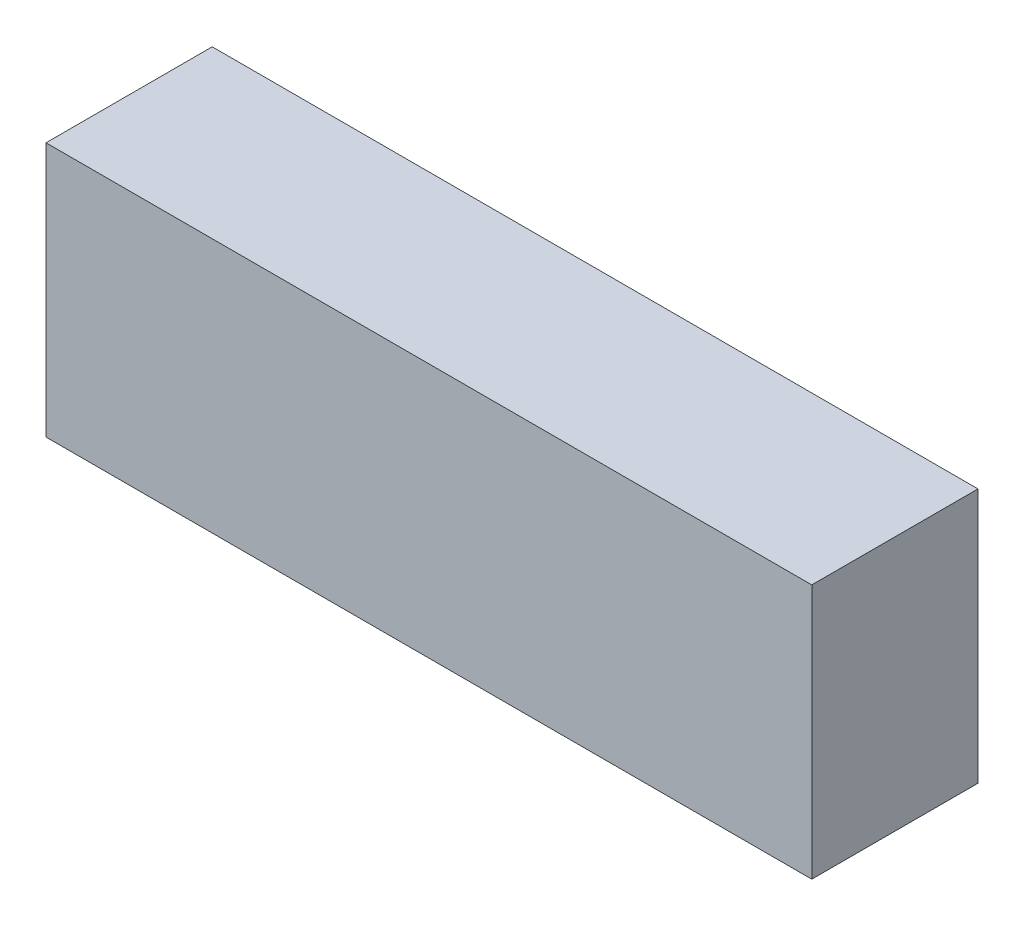
ISO-10303-21;
HEADER;
FILE_DESCRIPTION(('STEP AP214'),'2;1');
FILE_NAME('part.step','',(''),(''),'','','');
FILE_SCHEMA(('AUTOMOTIVE_DESIGN { 1 0 10303 214 1 1 1 1 }'));
ENDSEC;
DATA;
#1=APPLICATION_CONTEXT('core data for automotive mechanical design processes');
#2=APPLICATION_PROTOCOL_DEFINITION('international standard','automotive_design',2000,#1);
#3=PRODUCT_CONTEXT('',#1,'mechanical');
#4=PRODUCT('Part','Part','',(#3));
#5=PRODUCT_RELATED_PRODUCT_CATEGORY('part','',(#4));
#6=PRODUCT_DEFINITION_FORMATION('','',#4);
#7=PRODUCT_DEFINITION_CONTEXT('part definition',#1,'design');
#8=PRODUCT_DEFINITION('design','',#6,#7);
#9=PRODUCT_DEFINITION_SHAPE('','',#8);
#10=(LENGTH_UNIT() NAMED_UNIT(*) SI_UNIT(.MILLI.,.METRE.));
#11=(NAMED_UNIT(*) PLANE_ANGLE_UNIT() SI_UNIT($,.RADIAN.));
#12=(NAMED_UNIT(*) SI_UNIT($,.STERADIAN.) SOLID_ANGLE_UNIT());
#13=UNCERTAINTY_MEASURE_WITH_UNIT(LENGTH_MEASURE(1.E-05),#10,'distance_accuracy_value','');
#14=(GEOMETRIC_REPRESENTATION_CONTEXT(3) GLOBAL_UNCERTAINTY_ASSIGNED_CONTEXT((#13)) GLOBAL_UNIT_ASSIGNED_CONTEXT((#10,
#11,#12)) REPRESENTATION_CONTEXT('',''));
#15=CARTESIAN_POINT('',(0.,0.,0.));
#16=DIRECTION('',(0.,0.,1.));
#17=DIRECTION('',(1.,0.,0.));
#18=AXIS2_PLACEMENT_3D('',#15,#16,#17);
#19=CARTESIAN_POINT('',(43.8785,14.605,19.05));
#20=DIRECTION('',(-1.,0.,0.));
#21=DIRECTION('',(0.,-1.,0.));
#22=AXIS2_PLACEMENT_3D('',#19,#20,#21);
#23=PLANE('',#22);
#24=DIRECTION('',(0.,1.,0.));
#25=VECTOR('',#24,1.);
#26=CARTESIAN_POINT('',(43.8785,14.605,0.));
#27=LINE('',#26,#25);
#28=CARTESIAN_POINT('',(43.8785,-14.605,0.));
#29=VERTEX_POINT('',#28);
#30=CARTESIAN_POINT('',(43.8785,14.605,0.));
#31=VERTEX_POINT('',#30);
#32=EDGE_CURVE('E111',#29,#31,#27,.T.);
#33=ORIENTED_EDGE('',*,*,#32,.T.);
#34=DIRECTION('',(0.,0.,-1.));
#35=VECTOR('',#34,1.);
#36=CARTESIAN_POINT('',(43.8785,14.605,19.05));
#37=LINE('',#36,#35);
#38=CARTESIAN_POINT('',(43.8785,14.605,19.05));
#39=VERTEX_POINT('',#38);
#40=EDGE_CURVE('E11',#39,#31,#37,.T.);
#41=ORIENTED_EDGE('',*,*,#40,.F.);
#42=DIRECTION('',(0.,1.,0.));
#43=VECTOR('',#42,1.);
#44=CARTESIAN_POINT('',(43.8785,14.605,19.05));
#45=LINE('',#44,#43);
#46=CARTESIAN_POINT('',(43.8785,-14.605,19.05));
#47=VERTEX_POINT('',#46);
#48=EDGE_CURVE('E95',#47,#39,#45,.T.);
#49=ORIENTED_EDGE('',*,*,#48,.F.);
#50=DIRECTION('',(0.,0.,-1.));
#51=VECTOR('',#50,1.);
#52=CARTESIAN_POINT('',(43.8785,-14.605,19.05));
#53=LINE('',#52,#51);
#54=EDGE_CURVE('E107',#47,#29,#53,.T.);
#55=ORIENTED_EDGE('',*,*,#54,.T.);
#56=EDGE_LOOP('',(#33,#41,#49,#55));
#57=FACE_BOUND('',#56,.T.);
#58=ADVANCED_FACE('F43',(#57),#23,.F.);
#59=CARTESIAN_POINT('',(-43.8785,14.605,19.05));
#60=DIRECTION('',(0.,-1.,0.));
#61=DIRECTION('',(0.,0.,-1.));
#62=AXIS2_PLACEMENT_3D('',#59,#60,#61);
#63=PLANE('',#62);
#64=DIRECTION('',(-1.,0.,0.));
#65=VECTOR('',#64,1.);
#66=CARTESIAN_POINT('',(-43.8785,14.605,0.));
#67=LINE('',#66,#65);
#68=CARTESIAN_POINT('',(-43.8785,14.605,0.));
#69=VERTEX_POINT('',#68);
#70=EDGE_CURVE('E100',#31,#69,#67,.T.);
#71=ORIENTED_EDGE('',*,*,#70,.T.);
#72=DIRECTION('',(0.,0.,-1.));
#73=VECTOR('',#72,1.);
#74=CARTESIAN_POINT('',(-43.8785,14.605,19.05));
#75=LINE('',#74,#73);
#76=CARTESIAN_POINT('',(-43.8785,14.605,19.05));
#77=VERTEX_POINT('',#76);
#78=EDGE_CURVE('E52',#77,#69,#75,.T.);
#79=ORIENTED_EDGE('',*,*,#78,.F.);
#80=DIRECTION('',(-1.,0.,0.));
#81=VECTOR('',#80,1.);
#82=CARTESIAN_POINT('',(-43.8785,14.605,19.05));
#83=LINE('',#82,#81);
#84=EDGE_CURVE('E90',#39,#77,#83,.T.);
#85=ORIENTED_EDGE('',*,*,#84,.F.);
#86=ORIENTED_EDGE('',*,*,#40,.T.);
#87=EDGE_LOOP('',(#71,#79,#85,#86));
#88=FACE_BOUND('',#87,.T.);
#89=ADVANCED_FACE('F99',(#88),#63,.F.);
#90=CARTESIAN_POINT('',(-43.8785,14.605,19.05));
#91=DIRECTION('',(1.,0.,0.));
#92=DIRECTION('',(0.,1.,0.));
#93=AXIS2_PLACEMENT_3D('',#90,#91,#92);
#94=PLANE('',#93);
#95=DIRECTION('',(0.,-1.,0.));
#96=VECTOR('',#95,1.);
#97=CARTESIAN_POINT('',(-43.8785,14.605,0.));
#98=LINE('',#97,#96);
#99=CARTESIAN_POINT('',(-43.8785,-14.605,0.));
#100=VERTEX_POINT('',#99);
#101=EDGE_CURVE('E77',#69,#100,#98,.T.);
#102=ORIENTED_EDGE('',*,*,#101,.T.);
#103=DIRECTION('',(0.,0.,-1.));
#104=VECTOR('',#103,1.);
#105=CARTESIAN_POINT('',(-43.8785,-14.605,19.05));
#106=LINE('',#105,#104);
#107=CARTESIAN_POINT('',(-43.8785,-14.605,19.05));
#108=VERTEX_POINT('',#107);
#109=EDGE_CURVE('E102',#108,#100,#106,.T.);
#110=ORIENTED_EDGE('',*,*,#109,.F.);
#111=DIRECTION('',(0.,-1.,0.));
#112=VECTOR('',#111,1.);
#113=CARTESIAN_POINT('',(-43.8785,14.605,19.05));
#114=LINE('',#113,#112);
#115=EDGE_CURVE('E93',#77,#108,#114,.T.);
#116=ORIENTED_EDGE('',*,*,#115,.F.);
#117=ORIENTED_EDGE('',*,*,#78,.T.);
#118=EDGE_LOOP('',(#102,#110,#116,#117));
#119=FACE_BOUND('',#118,.T.);
#120=ADVANCED_FACE('F103',(#119),#94,.F.);
#121=CARTESIAN_POINT('',(-43.8785,-14.605,19.05));
#122=DIRECTION('',(0.,1.,0.));
#123=DIRECTION('',(0.,0.,1.));
#124=AXIS2_PLACEMENT_3D('',#121,#122,#123);
#125=PLANE('',#124);
#126=DIRECTION('',(1.,0.,0.));
#127=VECTOR('',#126,1.);
#128=CARTESIAN_POINT('',(-43.8785,-14.605,0.));
#129=LINE('',#128,#127);
#130=EDGE_CURVE('E83',#100,#29,#129,.T.);
#131=ORIENTED_EDGE('',*,*,#130,.T.);
#132=ORIENTED_EDGE('',*,*,#54,.F.);
#133=DIRECTION('',(1.,0.,0.));
#134=VECTOR('',#133,1.);
#135=CARTESIAN_POINT('',(-43.8785,-14.605,19.05));
#136=LINE('',#135,#134);
#137=EDGE_CURVE('E60',#108,#47,#136,.T.);
#138=ORIENTED_EDGE('',*,*,#137,.F.);
#139=ORIENTED_EDGE('',*,*,#109,.T.);
#140=EDGE_LOOP('',(#131,#132,#138,#139));
#141=FACE_BOUND('',#140,.T.);
#142=ADVANCED_FACE('F124',(#141),#125,.F.);
#143=CARTESIAN_POINT('',(0.,0.,19.05));
#144=DIRECTION('',(0.,0.,1.));
#145=DIRECTION('',(1.,0.,0.));
#146=AXIS2_PLACEMENT_3D('',#143,#144,#145);
#147=PLANE('',#146);
#148=ORIENTED_EDGE('',*,*,#48,.T.);
#149=ORIENTED_EDGE('',*,*,#84,.T.);
#150=ORIENTED_EDGE('',*,*,#115,.T.);
#151=ORIENTED_EDGE('',*,*,#137,.T.);
#152=EDGE_LOOP('',(#148,#149,#150,#151));
#153=FACE_BOUND('',#152,.T.);
#154=ADVANCED_FACE('F91',(#153),#147,.T.);
#155=CARTESIAN_POINT('',(0.,0.,0.));
#156=DIRECTION('',(0.,0.,1.));
#157=DIRECTION('',(1.,0.,0.));
#158=AXIS2_PLACEMENT_3D('',#155,#156,#157);
#159=PLANE('',#158);
#160=ORIENTED_EDGE('',*,*,#32,.F.);
#161=ORIENTED_EDGE('',*,*,#130,.F.);
#162=ORIENTED_EDGE('',*,*,#101,.F.);
#163=ORIENTED_EDGE('',*,*,#70,.F.);
#164=EDGE_LOOP('',(#160,#161,#162,#163));
#165=FACE_BOUND('',#164,.T.);
#166=ADVANCED_FACE('F127',(#165),#159,.F.);
#167=CLOSED_SHELL('',(#58,#89,#120,#142,#154,#166));
#168=MANIFOLD_SOLID_BREP('B2',#167);
#169=ADVANCED_BREP_SHAPE_REPRESENTATION('',(#18,#168),#14);
#170=SHAPE_DEFINITION_REPRESENTATION(#9,#169);
ENDSEC;
END-ISO-10303-21;
